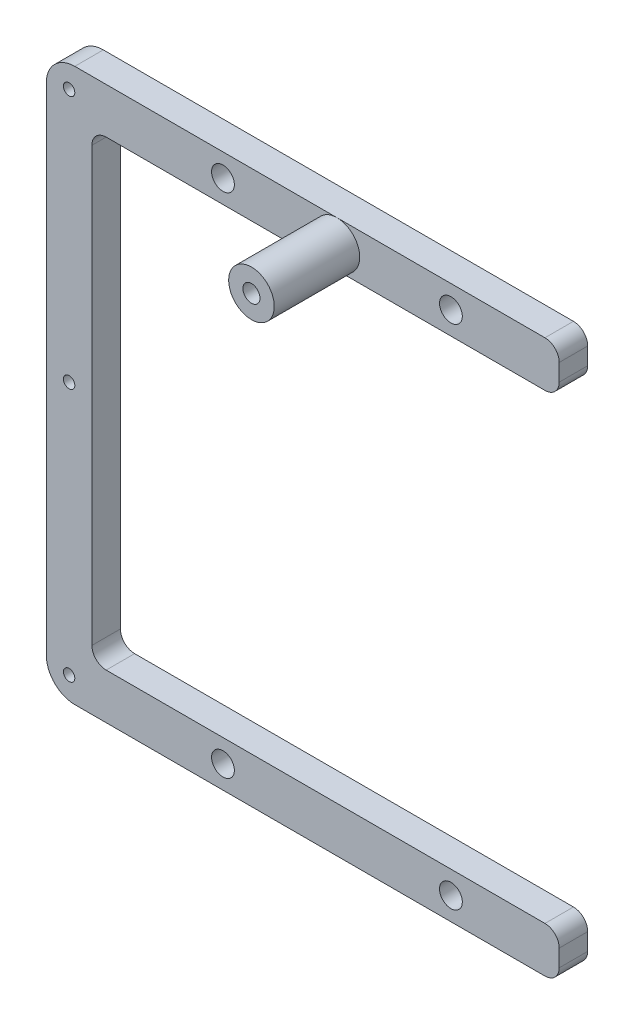
ISO-10303-21;
HEADER;
FILE_DESCRIPTION(('STEP AP214'),'2;1');
FILE_NAME('part.step','',(''),(''),'','','');
FILE_SCHEMA(('AUTOMOTIVE_DESIGN { 1 0 10303 214 1 1 1 1 }'));
ENDSEC;
DATA;
#1=APPLICATION_CONTEXT('core data for automotive mechanical design processes');
#2=APPLICATION_PROTOCOL_DEFINITION('international standard','automotive_design',2000,#1);
#3=PRODUCT_CONTEXT('',#1,'mechanical');
#4=PRODUCT('Part','Part','',(#3));
#5=PRODUCT_RELATED_PRODUCT_CATEGORY('part','',(#4));
#6=PRODUCT_DEFINITION_FORMATION('','',#4);
#7=PRODUCT_DEFINITION_CONTEXT('part definition',#1,'design');
#8=PRODUCT_DEFINITION('design','',#6,#7);
#9=PRODUCT_DEFINITION_SHAPE('','',#8);
#10=(LENGTH_UNIT() NAMED_UNIT(*) SI_UNIT(.MILLI.,.METRE.));
#11=(NAMED_UNIT(*) PLANE_ANGLE_UNIT() SI_UNIT($,.RADIAN.));
#12=(NAMED_UNIT(*) SI_UNIT($,.STERADIAN.) SOLID_ANGLE_UNIT());
#13=UNCERTAINTY_MEASURE_WITH_UNIT(LENGTH_MEASURE(1.E-05),#10,'distance_accuracy_value','');
#14=(GEOMETRIC_REPRESENTATION_CONTEXT(3) GLOBAL_UNCERTAINTY_ASSIGNED_CONTEXT((#13)) GLOBAL_UNIT_ASSIGNED_CONTEXT((#10,
#11,#12)) REPRESENTATION_CONTEXT('',''));
#15=CARTESIAN_POINT('',(0.,0.,0.));
#16=DIRECTION('',(0.,0.,1.));
#17=DIRECTION('',(1.,0.,0.));
#18=AXIS2_PLACEMENT_3D('',#15,#16,#17);
#19=CARTESIAN_POINT('',(5.,-43.5,5.));
#20=DIRECTION('',(0.,0.,-1.));
#21=DIRECTION('',(-1.,0.,0.));
#22=AXIS2_PLACEMENT_3D('',#19,#20,#21);
#23=CYLINDRICAL_SURFACE('',#22,5.);
#24=CARTESIAN_POINT('',(5.,-43.5,0.));
#25=DIRECTION('',(0.,0.,1.));
#26=DIRECTION('',(1.,0.,0.));
#27=AXIS2_PLACEMENT_3D('',#24,#25,#26);
#28=CIRCLE('',#27,5.);
#29=CARTESIAN_POINT('',(0.,-43.5,0.));
#30=VERTEX_POINT('',#29);
#31=CARTESIAN_POINT('',(5.00000000000001,-48.5,0.));
#32=VERTEX_POINT('',#31);
#33=EDGE_CURVE('P0_E160',#30,#32,#28,.T.);
#34=ORIENTED_EDGE('',*,*,#33,.T.);
#35=DIRECTION('',(0.,0.,-1.));
#36=VECTOR('',#35,1.);
#37=CARTESIAN_POINT('',(5.00000000000001,-48.5,5.));
#38=LINE('',#37,#36);
#39=CARTESIAN_POINT('',(5.00000000000001,-48.5,5.));
#40=VERTEX_POINT('',#39);
#41=EDGE_CURVE('P0_E11',#40,#32,#38,.T.);
#42=ORIENTED_EDGE('',*,*,#41,.F.);
#43=CARTESIAN_POINT('',(5.,-43.5,5.));
#44=DIRECTION('',(0.,0.,1.));
#45=DIRECTION('',(1.,0.,0.));
#46=AXIS2_PLACEMENT_3D('',#43,#44,#45);
#47=CIRCLE('',#46,5.);
#48=CARTESIAN_POINT('',(0.,-43.5,5.));
#49=VERTEX_POINT('',#48);
#50=EDGE_CURVE('P0_E191',#49,#40,#47,.T.);
#51=ORIENTED_EDGE('',*,*,#50,.F.);
#52=DIRECTION('',(0.,0.,-1.));
#53=VECTOR('',#52,1.);
#54=CARTESIAN_POINT('',(0.,-43.5,5.));
#55=LINE('',#54,#53);
#56=EDGE_CURVE('P0_E156',#49,#30,#55,.T.);
#57=ORIENTED_EDGE('',*,*,#56,.T.);
#58=EDGE_LOOP('',(#34,#42,#51,#57));
#59=FACE_BOUND('',#58,.T.);
#60=ADVANCED_FACE('P0_F16',(#59),#23,.T.);
#61=CARTESIAN_POINT('',(87.5,-48.5,5.));
#62=DIRECTION('',(0.,1.,0.));
#63=DIRECTION('',(-1.,0.,0.));
#64=AXIS2_PLACEMENT_3D('',#61,#62,#63);
#65=PLANE('',#64);
#66=DIRECTION('',(1.,0.,0.));
#67=VECTOR('',#66,1.);
#68=CARTESIAN_POINT('',(87.5,-48.5,0.));
#69=LINE('',#68,#67);
#70=CARTESIAN_POINT('',(87.5,-48.5,0.));
#71=VERTEX_POINT('',#70);
#72=EDGE_CURVE('P0_E163',#32,#71,#69,.T.);
#73=ORIENTED_EDGE('',*,*,#72,.T.);
#74=DIRECTION('',(0.,0.,-1.));
#75=VECTOR('',#74,1.);
#76=CARTESIAN_POINT('',(87.5,-48.5,5.));
#77=LINE('',#76,#75);
#78=CARTESIAN_POINT('',(87.5,-48.5,5.));
#79=VERTEX_POINT('',#78);
#80=EDGE_CURVE('P0_E24',#79,#71,#77,.T.);
#81=ORIENTED_EDGE('',*,*,#80,.F.);
#82=DIRECTION('',(1.,0.,0.));
#83=VECTOR('',#82,1.);
#84=CARTESIAN_POINT('',(87.5,-48.5,5.));
#85=LINE('',#84,#83);
#86=EDGE_CURVE('P0_E99',#40,#79,#85,.T.);
#87=ORIENTED_EDGE('',*,*,#86,.F.);
#88=ORIENTED_EDGE('',*,*,#41,.T.);
#89=EDGE_LOOP('',(#73,#81,#87,#88));
#90=FACE_BOUND('',#89,.T.);
#91=ADVANCED_FACE('P0_F291',(#90),#65,.F.);
#92=CARTESIAN_POINT('',(87.5,-46.,5.));
#93=DIRECTION('',(0.,0.,-1.));
#94=DIRECTION('',(-1.,0.,0.));
#95=AXIS2_PLACEMENT_3D('',#92,#93,#94);
#96=CYLINDRICAL_SURFACE('',#95,2.5);
#97=CARTESIAN_POINT('',(87.5,-46.,0.));
#98=DIRECTION('',(0.,0.,1.));
#99=DIRECTION('',(-1.,0.,0.));
#100=AXIS2_PLACEMENT_3D('',#97,#98,#99);
#101=CIRCLE('',#100,2.5);
#102=CARTESIAN_POINT('',(90.,-46.,0.));
#103=VERTEX_POINT('',#102);
#104=EDGE_CURVE('P0_E166',#71,#103,#101,.T.);
#105=ORIENTED_EDGE('',*,*,#104,.T.);
#106=DIRECTION('',(0.,0.,-1.));
#107=VECTOR('',#106,1.);
#108=CARTESIAN_POINT('',(90.,-46.,5.));
#109=LINE('',#108,#107);
#110=CARTESIAN_POINT('',(90.,-46.,5.));
#111=VERTEX_POINT('',#110);
#112=EDGE_CURVE('P0_E222',#111,#103,#109,.T.);
#113=ORIENTED_EDGE('',*,*,#112,.F.);
#114=CARTESIAN_POINT('',(87.5,-46.,5.));
#115=DIRECTION('',(0.,0.,1.));
#116=DIRECTION('',(-1.,0.,0.));
#117=AXIS2_PLACEMENT_3D('',#114,#115,#116);
#118=CIRCLE('',#117,2.5);
#119=EDGE_CURVE('P0_E230',#79,#111,#118,.T.);
#120=ORIENTED_EDGE('',*,*,#119,.F.);
#121=ORIENTED_EDGE('',*,*,#80,.T.);
#122=EDGE_LOOP('',(#105,#113,#120,#121));
#123=FACE_BOUND('',#122,.T.);
#124=ADVANCED_FACE('P0_F228',(#123),#96,.T.);
#125=CARTESIAN_POINT('',(90.,-43.,5.));
#126=DIRECTION('',(-1.,0.,0.));
#127=DIRECTION('',(0.,-1.,0.));
#128=AXIS2_PLACEMENT_3D('',#125,#126,#127);
#129=PLANE('',#128);
#130=DIRECTION('',(0.,1.,0.));
#131=VECTOR('',#130,1.);
#132=CARTESIAN_POINT('',(90.,-43.,0.));
#133=LINE('',#132,#131);
#134=CARTESIAN_POINT('',(90.,-43.,0.));
#135=VERTEX_POINT('',#134);
#136=EDGE_CURVE('P0_E168',#103,#135,#133,.T.);
#137=ORIENTED_EDGE('',*,*,#136,.T.);
#138=DIRECTION('',(0.,0.,-1.));
#139=VECTOR('',#138,1.);
#140=CARTESIAN_POINT('',(90.,-43.,5.));
#141=LINE('',#140,#139);
#142=CARTESIAN_POINT('',(90.,-43.,5.));
#143=VERTEX_POINT('',#142);
#144=EDGE_CURVE('P0_E219',#143,#135,#141,.T.);
#145=ORIENTED_EDGE('',*,*,#144,.F.);
#146=DIRECTION('',(0.,1.,0.));
#147=VECTOR('',#146,1.);
#148=CARTESIAN_POINT('',(90.,-43.,5.));
#149=LINE('',#148,#147);
#150=EDGE_CURVE('P0_E248',#111,#143,#149,.T.);
#151=ORIENTED_EDGE('',*,*,#150,.F.);
#152=ORIENTED_EDGE('',*,*,#112,.T.);
#153=EDGE_LOOP('',(#137,#145,#151,#152));
#154=FACE_BOUND('',#153,.T.);
#155=ADVANCED_FACE('P0_F239',(#154),#129,.F.);
#156=CARTESIAN_POINT('',(87.5,-43.,5.));
#157=DIRECTION('',(0.,0.,-1.));
#158=DIRECTION('',(-1.,0.,0.));
#159=AXIS2_PLACEMENT_3D('',#156,#157,#158);
#160=CYLINDRICAL_SURFACE('',#159,2.50000000000001);
#161=CARTESIAN_POINT('',(87.5,-43.,0.));
#162=DIRECTION('',(0.,0.,1.));
#163=DIRECTION('',(1.,0.,0.));
#164=AXIS2_PLACEMENT_3D('',#161,#162,#163);
#165=CIRCLE('',#164,2.50000000000001);
#166=CARTESIAN_POINT('',(87.5,-40.5,0.));
#167=VERTEX_POINT('',#166);
#168=EDGE_CURVE('P0_E170',#135,#167,#165,.T.);
#169=ORIENTED_EDGE('',*,*,#168,.T.);
#170=DIRECTION('',(0.,0.,-1.));
#171=VECTOR('',#170,1.);
#172=CARTESIAN_POINT('',(87.5,-40.5,5.));
#173=LINE('',#172,#171);
#174=CARTESIAN_POINT('',(87.5,-40.5,5.));
#175=VERTEX_POINT('',#174);
#176=EDGE_CURVE('P0_E216',#175,#167,#173,.T.);
#177=ORIENTED_EDGE('',*,*,#176,.F.);
#178=CARTESIAN_POINT('',(87.5,-43.,5.));
#179=DIRECTION('',(0.,0.,1.));
#180=DIRECTION('',(1.,0.,0.));
#181=AXIS2_PLACEMENT_3D('',#178,#179,#180);
#182=CIRCLE('',#181,2.50000000000001);
#183=EDGE_CURVE('P0_E245',#143,#175,#182,.T.);
#184=ORIENTED_EDGE('',*,*,#183,.F.);
#185=ORIENTED_EDGE('',*,*,#144,.T.);
#186=EDGE_LOOP('',(#169,#177,#184,#185));
#187=FACE_BOUND('',#186,.T.);
#188=ADVANCED_FACE('P0_F243',(#187),#160,.T.);
#189=CARTESIAN_POINT('',(10.5,-40.5,5.));
#190=DIRECTION('',(0.,-1.,0.));
#191=DIRECTION('',(1.,0.,0.));
#192=AXIS2_PLACEMENT_3D('',#189,#190,#191);
#193=PLANE('',#192);
#194=DIRECTION('',(-1.,0.,0.));
#195=VECTOR('',#194,1.);
#196=CARTESIAN_POINT('',(10.5,-40.5,0.));
#197=LINE('',#196,#195);
#198=CARTESIAN_POINT('',(10.5,-40.5,0.));
#199=VERTEX_POINT('',#198);
#200=EDGE_CURVE('P0_E172',#167,#199,#197,.T.);
#201=ORIENTED_EDGE('',*,*,#200,.T.);
#202=DIRECTION('',(0.,0.,-1.));
#203=VECTOR('',#202,1.);
#204=CARTESIAN_POINT('',(10.5,-40.5,5.));
#205=LINE('',#204,#203);
#206=CARTESIAN_POINT('',(10.5,-40.5,5.));
#207=VERTEX_POINT('',#206);
#208=EDGE_CURVE('P0_E213',#207,#199,#205,.T.);
#209=ORIENTED_EDGE('',*,*,#208,.F.);
#210=DIRECTION('',(-1.,0.,0.));
#211=VECTOR('',#210,1.);
#212=CARTESIAN_POINT('',(10.5,-40.5,5.));
#213=LINE('',#212,#211);
#214=EDGE_CURVE('P0_E247',#175,#207,#213,.T.);
#215=ORIENTED_EDGE('',*,*,#214,.F.);
#216=ORIENTED_EDGE('',*,*,#176,.T.);
#217=EDGE_LOOP('',(#201,#209,#215,#216));
#218=FACE_BOUND('',#217,.T.);
#219=ADVANCED_FACE('P0_F304',(#218),#193,.F.);
#220=CARTESIAN_POINT('',(10.5,-38.,5.));
#221=DIRECTION('',(0.,0.,-1.));
#222=DIRECTION('',(-1.,0.,0.));
#223=AXIS2_PLACEMENT_3D('',#220,#221,#222);
#224=CYLINDRICAL_SURFACE('',#223,2.50000000000001);
#225=CARTESIAN_POINT('',(10.5,-38.,0.));
#226=DIRECTION('',(0.,0.,-1.));
#227=DIRECTION('',(1.,0.,0.));
#228=AXIS2_PLACEMENT_3D('',#225,#226,#227);
#229=CIRCLE('',#228,2.50000000000001);
#230=CARTESIAN_POINT('',(8.00000000000001,-38.,0.));
#231=VERTEX_POINT('',#230);
#232=EDGE_CURVE('P0_E174',#199,#231,#229,.T.);
#233=ORIENTED_EDGE('',*,*,#232,.T.);
#234=DIRECTION('',(0.,0.,-1.));
#235=VECTOR('',#234,1.);
#236=CARTESIAN_POINT('',(8.00000000000001,-38.,5.));
#237=LINE('',#236,#235);
#238=CARTESIAN_POINT('',(8.00000000000001,-38.,5.));
#239=VERTEX_POINT('',#238);
#240=EDGE_CURVE('P0_E210',#239,#231,#237,.T.);
#241=ORIENTED_EDGE('',*,*,#240,.F.);
#242=CARTESIAN_POINT('',(10.5,-38.,5.));
#243=DIRECTION('',(0.,0.,-1.));
#244=DIRECTION('',(1.,0.,0.));
#245=AXIS2_PLACEMENT_3D('',#242,#243,#244);
#246=CIRCLE('',#245,2.50000000000001);
#247=EDGE_CURVE('P0_E250',#207,#239,#246,.T.);
#248=ORIENTED_EDGE('',*,*,#247,.F.);
#249=ORIENTED_EDGE('',*,*,#208,.T.);
#250=EDGE_LOOP('',(#233,#241,#248,#249));
#251=FACE_BOUND('',#250,.T.);
#252=ADVANCED_FACE('P0_F307',(#251),#224,.F.);
#253=CARTESIAN_POINT('',(8.,38.,5.));
#254=DIRECTION('',(-1.,0.,0.));
#255=DIRECTION('',(0.,-1.,0.));
#256=AXIS2_PLACEMENT_3D('',#253,#254,#255);
#257=PLANE('',#256);
#258=DIRECTION('',(0.,1.,0.));
#259=VECTOR('',#258,1.);
#260=CARTESIAN_POINT('',(8.,38.,0.));
#261=LINE('',#260,#259);
#262=CARTESIAN_POINT('',(8.,38.,0.));
#263=VERTEX_POINT('',#262);
#264=EDGE_CURVE('P0_E176',#231,#263,#261,.T.);
#265=ORIENTED_EDGE('',*,*,#264,.T.);
#266=DIRECTION('',(0.,0.,-1.));
#267=VECTOR('',#266,1.);
#268=CARTESIAN_POINT('',(8.,38.,5.));
#269=LINE('',#268,#267);
#270=CARTESIAN_POINT('',(8.,38.,5.));
#271=VERTEX_POINT('',#270);
#272=EDGE_CURVE('P0_E207',#271,#263,#269,.T.);
#273=ORIENTED_EDGE('',*,*,#272,.F.);
#274=DIRECTION('',(0.,1.,0.));
#275=VECTOR('',#274,1.);
#276=CARTESIAN_POINT('',(8.,38.,5.));
#277=LINE('',#276,#275);
#278=EDGE_CURVE('P0_E256',#239,#271,#277,.T.);
#279=ORIENTED_EDGE('',*,*,#278,.F.);
#280=ORIENTED_EDGE('',*,*,#240,.T.);
#281=EDGE_LOOP('',(#265,#273,#279,#280));
#282=FACE_BOUND('',#281,.T.);
#283=ADVANCED_FACE('P0_F311',(#282),#257,.F.);
#284=CARTESIAN_POINT('',(10.5,38.,5.));
#285=DIRECTION('',(0.,0.,-1.));
#286=DIRECTION('',(-1.,0.,0.));
#287=AXIS2_PLACEMENT_3D('',#284,#285,#286);
#288=CYLINDRICAL_SURFACE('',#287,2.50000000000001);
#289=CARTESIAN_POINT('',(10.5,38.,0.));
#290=DIRECTION('',(0.,0.,-1.));
#291=DIRECTION('',(1.,0.,0.));
#292=AXIS2_PLACEMENT_3D('',#289,#290,#291);
#293=CIRCLE('',#292,2.50000000000001);
#294=CARTESIAN_POINT('',(10.5,40.5,0.));
#295=VERTEX_POINT('',#294);
#296=EDGE_CURVE('P0_E178',#263,#295,#293,.T.);
#297=ORIENTED_EDGE('',*,*,#296,.T.);
#298=DIRECTION('',(0.,0.,-1.));
#299=VECTOR('',#298,1.);
#300=CARTESIAN_POINT('',(10.5,40.5,5.));
#301=LINE('',#300,#299);
#302=CARTESIAN_POINT('',(10.5,40.5,5.));
#303=VERTEX_POINT('',#302);
#304=EDGE_CURVE('P0_E204',#303,#295,#301,.T.);
#305=ORIENTED_EDGE('',*,*,#304,.F.);
#306=CARTESIAN_POINT('',(10.5,38.,5.));
#307=DIRECTION('',(0.,0.,-1.));
#308=DIRECTION('',(1.,0.,0.));
#309=AXIS2_PLACEMENT_3D('',#306,#307,#308);
#310=CIRCLE('',#309,2.50000000000001);
#311=EDGE_CURVE('P0_E258',#271,#303,#310,.T.);
#312=ORIENTED_EDGE('',*,*,#311,.F.);
#313=ORIENTED_EDGE('',*,*,#272,.T.);
#314=EDGE_LOOP('',(#297,#305,#312,#313));
#315=FACE_BOUND('',#314,.T.);
#316=ADVANCED_FACE('P0_F315',(#315),#288,.F.);
#317=CARTESIAN_POINT('',(87.5,40.5,5.));
#318=DIRECTION('',(0.,1.,0.));
#319=DIRECTION('',(0.,0.,1.));
#320=AXIS2_PLACEMENT_3D('',#317,#318,#319);
#321=PLANE('',#320);
#322=DIRECTION('',(1.,0.,0.));
#323=VECTOR('',#322,1.);
#324=CARTESIAN_POINT('',(87.5,40.5,0.));
#325=LINE('',#324,#323);
#326=CARTESIAN_POINT('',(87.5,40.5,0.));
#327=VERTEX_POINT('',#326);
#328=EDGE_CURVE('P0_E180',#295,#327,#325,.T.);
#329=ORIENTED_EDGE('',*,*,#328,.T.);
#330=DIRECTION('',(0.,0.,-1.));
#331=VECTOR('',#330,1.);
#332=CARTESIAN_POINT('',(87.5,40.5,5.));
#333=LINE('',#332,#331);
#334=CARTESIAN_POINT('',(87.5,40.5,5.));
#335=VERTEX_POINT('',#334);
#336=EDGE_CURVE('P0_E201',#335,#327,#333,.T.);
#337=ORIENTED_EDGE('',*,*,#336,.F.);
#338=DIRECTION('',(1.,0.,0.));
#339=VECTOR('',#338,1.);
#340=CARTESIAN_POINT('',(87.5,40.5,5.));
#341=LINE('',#340,#339);
#342=EDGE_CURVE('P0_E260',#303,#335,#341,.T.);
#343=ORIENTED_EDGE('',*,*,#342,.F.);
#344=ORIENTED_EDGE('',*,*,#304,.T.);
#345=EDGE_LOOP('',(#329,#337,#343,#344));
#346=FACE_BOUND('',#345,.T.);
#347=ADVANCED_FACE('P0_F319',(#346),#321,.F.);
#348=CARTESIAN_POINT('',(87.5,43.,5.));
#349=DIRECTION('',(0.,0.,-1.));
#350=DIRECTION('',(-1.,0.,0.));
#351=AXIS2_PLACEMENT_3D('',#348,#349,#350);
#352=CYLINDRICAL_SURFACE('',#351,2.5);
#353=CARTESIAN_POINT('',(87.5,43.,0.));
#354=DIRECTION('',(0.,0.,1.));
#355=DIRECTION('',(-1.,0.,0.));
#356=AXIS2_PLACEMENT_3D('',#353,#354,#355);
#357=CIRCLE('',#356,2.5);
#358=CARTESIAN_POINT('',(90.,43.,0.));
#359=VERTEX_POINT('',#358);
#360=EDGE_CURVE('P0_E182',#327,#359,#357,.T.);
#361=ORIENTED_EDGE('',*,*,#360,.T.);
#362=DIRECTION('',(0.,0.,-1.));
#363=VECTOR('',#362,1.);
#364=CARTESIAN_POINT('',(90.,43.,5.));
#365=LINE('',#364,#363);
#366=CARTESIAN_POINT('',(90.,43.,5.));
#367=VERTEX_POINT('',#366);
#368=EDGE_CURVE('P0_E198',#367,#359,#365,.T.);
#369=ORIENTED_EDGE('',*,*,#368,.F.);
#370=CARTESIAN_POINT('',(87.5,43.,5.));
#371=DIRECTION('',(0.,0.,1.));
#372=DIRECTION('',(-1.,0.,0.));
#373=AXIS2_PLACEMENT_3D('',#370,#371,#372);
#374=CIRCLE('',#373,2.5);
#375=EDGE_CURVE('P0_E262',#335,#367,#374,.T.);
#376=ORIENTED_EDGE('',*,*,#375,.F.);
#377=ORIENTED_EDGE('',*,*,#336,.T.);
#378=EDGE_LOOP('',(#361,#369,#376,#377));
#379=FACE_BOUND('',#378,.T.);
#380=ADVANCED_FACE('P0_F323',(#379),#352,.T.);
#381=CARTESIAN_POINT('',(90.,46.,5.));
#382=DIRECTION('',(-1.,0.,0.));
#383=DIRECTION('',(0.,0.,1.));
#384=AXIS2_PLACEMENT_3D('',#381,#382,#383);
#385=PLANE('',#384);
#386=DIRECTION('',(0.,1.,0.));
#387=VECTOR('',#386,1.);
#388=CARTESIAN_POINT('',(90.,46.,0.));
#389=LINE('',#388,#387);
#390=CARTESIAN_POINT('',(90.,46.,0.));
#391=VERTEX_POINT('',#390);
#392=EDGE_CURVE('P0_E184',#359,#391,#389,.T.);
#393=ORIENTED_EDGE('',*,*,#392,.T.);
#394=DIRECTION('',(0.,0.,-1.));
#395=VECTOR('',#394,1.);
#396=CARTESIAN_POINT('',(90.,46.,5.));
#397=LINE('',#396,#395);
#398=CARTESIAN_POINT('',(90.,46.,5.));
#399=VERTEX_POINT('',#398);
#400=EDGE_CURVE('P0_E195',#399,#391,#397,.T.);
#401=ORIENTED_EDGE('',*,*,#400,.F.);
#402=DIRECTION('',(0.,1.,0.));
#403=VECTOR('',#402,1.);
#404=CARTESIAN_POINT('',(90.,46.,5.));
#405=LINE('',#404,#403);
#406=EDGE_CURVE('P0_E264',#367,#399,#405,.T.);
#407=ORIENTED_EDGE('',*,*,#406,.F.);
#408=ORIENTED_EDGE('',*,*,#368,.T.);
#409=EDGE_LOOP('',(#393,#401,#407,#408));
#410=FACE_BOUND('',#409,.T.);
#411=ADVANCED_FACE('P0_F270',(#410),#385,.F.);
#412=CARTESIAN_POINT('',(87.5,46.,5.));
#413=DIRECTION('',(0.,0.,-1.));
#414=DIRECTION('',(-1.,0.,0.));
#415=AXIS2_PLACEMENT_3D('',#412,#413,#414);
#416=CYLINDRICAL_SURFACE('',#415,2.5);
#417=CARTESIAN_POINT('',(87.5,46.,0.));
#418=DIRECTION('',(0.,0.,1.));
#419=DIRECTION('',(-1.,0.,0.));
#420=AXIS2_PLACEMENT_3D('',#417,#418,#419);
#421=CIRCLE('',#420,2.5);
#422=CARTESIAN_POINT('',(87.5,48.5,0.));
#423=VERTEX_POINT('',#422);
#424=EDGE_CURVE('P0_E186',#391,#423,#421,.T.);
#425=ORIENTED_EDGE('',*,*,#424,.T.);
#426=DIRECTION('',(0.,0.,-1.));
#427=VECTOR('',#426,1.);
#428=CARTESIAN_POINT('',(87.5,48.5,5.));
#429=LINE('',#428,#427);
#430=CARTESIAN_POINT('',(87.5,48.5,5.));
#431=VERTEX_POINT('',#430);
#432=EDGE_CURVE('P0_E151',#431,#423,#429,.T.);
#433=ORIENTED_EDGE('',*,*,#432,.F.);
#434=CARTESIAN_POINT('',(87.5,46.,5.));
#435=DIRECTION('',(0.,0.,1.));
#436=DIRECTION('',(-1.,0.,0.));
#437=AXIS2_PLACEMENT_3D('',#434,#435,#436);
#438=CIRCLE('',#437,2.5);
#439=EDGE_CURVE('P0_E142',#399,#431,#438,.T.);
#440=ORIENTED_EDGE('',*,*,#439,.F.);
#441=ORIENTED_EDGE('',*,*,#400,.T.);
#442=EDGE_LOOP('',(#425,#433,#440,#441));
#443=FACE_BOUND('',#442,.T.);
#444=ADVANCED_FACE('P0_F274',(#443),#416,.T.);
#445=CARTESIAN_POINT('',(4.99999999999999,48.5,5.));
#446=DIRECTION('',(0.,-1.,0.));
#447=DIRECTION('',(0.,0.,-1.));
#448=AXIS2_PLACEMENT_3D('',#445,#446,#447);
#449=PLANE('',#448);
#450=DIRECTION('',(-1.,0.,0.));
#451=VECTOR('',#450,1.);
#452=CARTESIAN_POINT('',(4.99999999999999,48.5,0.));
#453=LINE('',#452,#451);
#454=CARTESIAN_POINT('',(4.99999999999999,48.5,0.));
#455=VERTEX_POINT('',#454);
#456=EDGE_CURVE('P0_E150',#423,#455,#453,.T.);
#457=ORIENTED_EDGE('',*,*,#456,.T.);
#458=DIRECTION('',(0.,0.,-1.));
#459=VECTOR('',#458,1.);
#460=CARTESIAN_POINT('',(4.99999999999999,48.5,5.));
#461=LINE('',#460,#459);
#462=CARTESIAN_POINT('',(4.99999999999999,48.5,5.));
#463=VERTEX_POINT('',#462);
#464=EDGE_CURVE('P0_E147',#463,#455,#461,.T.);
#465=ORIENTED_EDGE('',*,*,#464,.F.);
#466=DIRECTION('',(-1.,0.,0.));
#467=VECTOR('',#466,1.);
#468=CARTESIAN_POINT('',(4.99999999999999,48.5,5.));
#469=LINE('',#468,#467);
#470=EDGE_CURVE('P0_E136',#431,#463,#469,.T.);
#471=ORIENTED_EDGE('',*,*,#470,.F.);
#472=ORIENTED_EDGE('',*,*,#432,.T.);
#473=EDGE_LOOP('',(#457,#465,#471,#472));
#474=FACE_BOUND('',#473,.T.);
#475=ADVANCED_FACE('P0_F148',(#474),#449,.F.);
#476=CARTESIAN_POINT('',(4.99999999999999,43.5,5.));
#477=DIRECTION('',(0.,0.,-1.));
#478=DIRECTION('',(-1.,0.,0.));
#479=AXIS2_PLACEMENT_3D('',#476,#477,#478);
#480=CYLINDRICAL_SURFACE('',#479,5.);
#481=CARTESIAN_POINT('',(4.99999999999999,43.5,0.));
#482=DIRECTION('',(0.,0.,1.));
#483=DIRECTION('',(-1.,0.,0.));
#484=AXIS2_PLACEMENT_3D('',#481,#482,#483);
#485=CIRCLE('',#484,5.);
#486=CARTESIAN_POINT('',(0.,43.5,0.));
#487=VERTEX_POINT('',#486);
#488=EDGE_CURVE('P0_E85',#455,#487,#485,.T.);
#489=ORIENTED_EDGE('',*,*,#488,.T.);
#490=DIRECTION('',(0.,0.,-1.));
#491=VECTOR('',#490,1.);
#492=CARTESIAN_POINT('',(0.,43.5,5.));
#493=LINE('',#492,#491);
#494=CARTESIAN_POINT('',(0.,43.5,5.));
#495=VERTEX_POINT('',#494);
#496=EDGE_CURVE('P0_E152',#495,#487,#493,.T.);
#497=ORIENTED_EDGE('',*,*,#496,.F.);
#498=CARTESIAN_POINT('',(4.99999999999999,43.5,5.));
#499=DIRECTION('',(0.,0.,1.));
#500=DIRECTION('',(-1.,0.,0.));
#501=AXIS2_PLACEMENT_3D('',#498,#499,#500);
#502=CIRCLE('',#501,5.);
#503=EDGE_CURVE('P0_E140',#463,#495,#502,.T.);
#504=ORIENTED_EDGE('',*,*,#503,.F.);
#505=ORIENTED_EDGE('',*,*,#464,.T.);
#506=EDGE_LOOP('',(#489,#497,#504,#505));
#507=FACE_BOUND('',#506,.T.);
#508=ADVANCED_FACE('P0_F154',(#507),#480,.T.);
#509=CARTESIAN_POINT('',(0.,-43.5,5.));
#510=DIRECTION('',(1.,0.,0.));
#511=DIRECTION('',(0.,1.,0.));
#512=AXIS2_PLACEMENT_3D('',#509,#510,#511);
#513=PLANE('',#512);
#514=DIRECTION('',(0.,-1.,0.));
#515=VECTOR('',#514,1.);
#516=CARTESIAN_POINT('',(0.,-43.5,0.));
#517=LINE('',#516,#515);
#518=EDGE_CURVE('P0_E91',#487,#30,#517,.T.);
#519=ORIENTED_EDGE('',*,*,#518,.T.);
#520=ORIENTED_EDGE('',*,*,#56,.F.);
#521=DIRECTION('',(0.,-1.,0.));
#522=VECTOR('',#521,1.);
#523=CARTESIAN_POINT('',(0.,-43.5,5.));
#524=LINE('',#523,#522);
#525=EDGE_CURVE('P0_E32',#495,#49,#524,.T.);
#526=ORIENTED_EDGE('',*,*,#525,.F.);
#527=ORIENTED_EDGE('',*,*,#496,.T.);
#528=EDGE_LOOP('',(#519,#520,#526,#527));
#529=FACE_BOUND('',#528,.T.);
#530=ADVANCED_FACE('P0_F278',(#529),#513,.F.);
#531=CARTESIAN_POINT('',(5.,-43.5,5.));
#532=DIRECTION('',(0.,0.,1.));
#533=DIRECTION('',(1.,0.,0.));
#534=AXIS2_PLACEMENT_3D('',#531,#532,#533);
#535=PLANE('',#534);
#536=CARTESIAN_POINT('',(3.99999999999999,44.5,5.));
#537=DIRECTION('',(0.,0.,1.));
#538=DIRECTION('',(1.,0.,0.));
#539=AXIS2_PLACEMENT_3D('',#536,#537,#538);
#540=CIRCLE('',#539,1.);
#541=CARTESIAN_POINT('',(4.99999999999999,44.5,5.));
#542=VERTEX_POINT('',#541);
#543=EDGE_CURVE('P0_E618',#542,#542,#540,.T.);
#544=ORIENTED_EDGE('',*,*,#543,.F.);
#545=EDGE_LOOP('',(#544));
#546=FACE_BOUND('',#545,.T.);
#547=CARTESIAN_POINT('',(4.,-44.5,5.));
#548=DIRECTION('',(0.,0.,1.));
#549=DIRECTION('',(1.,0.,0.));
#550=AXIS2_PLACEMENT_3D('',#547,#548,#549);
#551=CIRCLE('',#550,1.);
#552=CARTESIAN_POINT('',(5.,-44.5,5.));
#553=VERTEX_POINT('',#552);
#554=EDGE_CURVE('P0_E632',#553,#553,#551,.T.);
#555=ORIENTED_EDGE('',*,*,#554,.F.);
#556=EDGE_LOOP('',(#555));
#557=FACE_BOUND('',#556,.T.);
#558=CARTESIAN_POINT('',(4.,0.,5.));
#559=DIRECTION('',(0.,0.,1.));
#560=DIRECTION('',(1.,0.,0.));
#561=AXIS2_PLACEMENT_3D('',#558,#559,#560);
#562=CIRCLE('',#561,1.);
#563=CARTESIAN_POINT('',(5.,0.,5.));
#564=VERTEX_POINT('',#563);
#565=EDGE_CURVE('P0_E629',#564,#564,#562,.T.);
#566=ORIENTED_EDGE('',*,*,#565,.F.);
#567=EDGE_LOOP('',(#566));
#568=FACE_BOUND('',#567,.T.);
#569=CARTESIAN_POINT('',(31.,44.5,5.));
#570=DIRECTION('',(0.,0.,1.));
#571=DIRECTION('',(1.,0.,0.));
#572=AXIS2_PLACEMENT_3D('',#569,#570,#571);
#573=CIRCLE('',#572,2.00000000000001);
#574=CARTESIAN_POINT('',(33.,44.5,5.));
#575=VERTEX_POINT('',#574);
#576=EDGE_CURVE('P0_E645',#575,#575,#573,.T.);
#577=ORIENTED_EDGE('',*,*,#576,.F.);
#578=EDGE_LOOP('',(#577));
#579=FACE_BOUND('',#578,.T.);
#580=CARTESIAN_POINT('',(71.,-44.5,5.));
#581=DIRECTION('',(0.,0.,1.));
#582=DIRECTION('',(-1.,0.,0.));
#583=AXIS2_PLACEMENT_3D('',#580,#581,#582);
#584=CIRCLE('',#583,2.);
#585=CARTESIAN_POINT('',(69.,-44.5,5.));
#586=VERTEX_POINT('',#585);
#587=EDGE_CURVE('P0_E652',#586,#586,#584,.T.);
#588=ORIENTED_EDGE('',*,*,#587,.F.);
#589=EDGE_LOOP('',(#588));
#590=FACE_BOUND('',#589,.T.);
#591=CARTESIAN_POINT('',(31.,-44.5,5.));
#592=DIRECTION('',(0.,0.,1.));
#593=DIRECTION('',(-1.,0.,0.));
#594=AXIS2_PLACEMENT_3D('',#591,#592,#593);
#595=CIRCLE('',#594,2.00000000000001);
#596=CARTESIAN_POINT('',(29.,-44.5,5.));
#597=VERTEX_POINT('',#596);
#598=EDGE_CURVE('P0_E633',#597,#597,#595,.T.);
#599=ORIENTED_EDGE('',*,*,#598,.F.);
#600=EDGE_LOOP('',(#599));
#601=FACE_BOUND('',#600,.T.);
#602=CARTESIAN_POINT('',(51.,44.5,5.));
#603=DIRECTION('',(0.,0.,1.));
#604=DIRECTION('',(1.,0.,0.));
#605=AXIS2_PLACEMENT_3D('',#602,#603,#604);
#606=CIRCLE('',#605,2.);
#607=CARTESIAN_POINT('',(53.,44.5,5.));
#608=VERTEX_POINT('',#607);
#609=EDGE_CURVE('P0_E640',#608,#608,#606,.T.);
#610=ORIENTED_EDGE('',*,*,#609,.F.);
#611=EDGE_LOOP('',(#610));
#612=FACE_BOUND('',#611,.T.);
#613=CARTESIAN_POINT('',(71.,44.5,5.));
#614=DIRECTION('',(0.,0.,1.));
#615=DIRECTION('',(1.,0.,0.));
#616=AXIS2_PLACEMENT_3D('',#613,#614,#615);
#617=CIRCLE('',#616,2.);
#618=CARTESIAN_POINT('',(73.,44.5,5.));
#619=VERTEX_POINT('',#618);
#620=EDGE_CURVE('P0_E648',#619,#619,#617,.T.);
#621=ORIENTED_EDGE('',*,*,#620,.F.);
#622=EDGE_LOOP('',(#621));
#623=FACE_BOUND('',#622,.T.);
#624=ORIENTED_EDGE('',*,*,#50,.T.);
#625=ORIENTED_EDGE('',*,*,#86,.T.);
#626=ORIENTED_EDGE('',*,*,#119,.T.);
#627=ORIENTED_EDGE('',*,*,#150,.T.);
#628=ORIENTED_EDGE('',*,*,#183,.T.);
#629=ORIENTED_EDGE('',*,*,#214,.T.);
#630=ORIENTED_EDGE('',*,*,#247,.T.);
#631=ORIENTED_EDGE('',*,*,#278,.T.);
#632=ORIENTED_EDGE('',*,*,#311,.T.);
#633=ORIENTED_EDGE('',*,*,#342,.T.);
#634=ORIENTED_EDGE('',*,*,#375,.T.);
#635=ORIENTED_EDGE('',*,*,#406,.T.);
#636=ORIENTED_EDGE('',*,*,#439,.T.);
#637=ORIENTED_EDGE('',*,*,#470,.T.);
#638=ORIENTED_EDGE('',*,*,#503,.T.);
#639=ORIENTED_EDGE('',*,*,#525,.T.);
#640=EDGE_LOOP('',(#624,#625,#626,#627,#628,#629,#630,#631,#632,#633,#634,#635,#636,#637,#638,#639));
#641=FACE_BOUND('',#640,.T.);
#642=ADVANCED_FACE('P0_F138',(#546,#557,#568,#579,#590,#601,#612,#623,#641),#535,.T.);
#643=CARTESIAN_POINT('',(5.,-43.5,0.));
#644=DIRECTION('',(0.,0.,1.));
#645=DIRECTION('',(1.,0.,0.));
#646=AXIS2_PLACEMENT_3D('',#643,#644,#645);
#647=PLANE('',#646);
#648=CARTESIAN_POINT('',(31.,44.5,0.));
#649=DIRECTION('',(0.,0.,1.));
#650=DIRECTION('',(1.,0.,0.));
#651=AXIS2_PLACEMENT_3D('',#648,#649,#650);
#652=CIRCLE('',#651,2.00000000000001);
#653=CARTESIAN_POINT('',(33.,44.5,0.));
#654=VERTEX_POINT('',#653);
#655=EDGE_CURVE('P0_E649',#654,#654,#652,.T.);
#656=ORIENTED_EDGE('',*,*,#655,.T.);
#657=EDGE_LOOP('',(#656));
#658=FACE_BOUND('',#657,.T.);
#659=CARTESIAN_POINT('',(71.,-44.5,0.));
#660=DIRECTION('',(0.,0.,1.));
#661=DIRECTION('',(-1.,0.,0.));
#662=AXIS2_PLACEMENT_3D('',#659,#660,#661);
#663=CIRCLE('',#662,2.);
#664=CARTESIAN_POINT('',(69.,-44.5,0.));
#665=VERTEX_POINT('',#664);
#666=EDGE_CURVE('P0_E636',#665,#665,#663,.T.);
#667=ORIENTED_EDGE('',*,*,#666,.T.);
#668=EDGE_LOOP('',(#667));
#669=FACE_BOUND('',#668,.T.);
#670=CARTESIAN_POINT('',(31.,-44.5,0.));
#671=DIRECTION('',(0.,0.,1.));
#672=DIRECTION('',(-1.,0.,0.));
#673=AXIS2_PLACEMENT_3D('',#670,#671,#672);
#674=CIRCLE('',#673,2.00000000000001);
#675=CARTESIAN_POINT('',(29.,-44.5,0.));
#676=VERTEX_POINT('',#675);
#677=EDGE_CURVE('P0_E637',#676,#676,#674,.T.);
#678=ORIENTED_EDGE('',*,*,#677,.T.);
#679=EDGE_LOOP('',(#678));
#680=FACE_BOUND('',#679,.T.);
#681=CARTESIAN_POINT('',(51.,44.5,0.));
#682=DIRECTION('',(0.,0.,1.));
#683=DIRECTION('',(1.,0.,0.));
#684=AXIS2_PLACEMENT_3D('',#681,#682,#683);
#685=CIRCLE('',#684,2.);
#686=CARTESIAN_POINT('',(53.,44.5,0.));
#687=VERTEX_POINT('',#686);
#688=EDGE_CURVE('P0_E628',#687,#687,#685,.T.);
#689=ORIENTED_EDGE('',*,*,#688,.T.);
#690=EDGE_LOOP('',(#689));
#691=FACE_BOUND('',#690,.T.);
#692=CARTESIAN_POINT('',(71.,44.5,0.));
#693=DIRECTION('',(0.,0.,1.));
#694=DIRECTION('',(1.,0.,0.));
#695=AXIS2_PLACEMENT_3D('',#692,#693,#694);
#696=CIRCLE('',#695,2.);
#697=CARTESIAN_POINT('',(73.,44.5,0.));
#698=VERTEX_POINT('',#697);
#699=EDGE_CURVE('P0_E164',#698,#698,#696,.T.);
#700=ORIENTED_EDGE('',*,*,#699,.T.);
#701=EDGE_LOOP('',(#700));
#702=FACE_BOUND('',#701,.T.);
#703=ORIENTED_EDGE('',*,*,#33,.F.);
#704=ORIENTED_EDGE('',*,*,#518,.F.);
#705=ORIENTED_EDGE('',*,*,#488,.F.);
#706=ORIENTED_EDGE('',*,*,#456,.F.);
#707=ORIENTED_EDGE('',*,*,#424,.F.);
#708=ORIENTED_EDGE('',*,*,#392,.F.);
#709=ORIENTED_EDGE('',*,*,#360,.F.);
#710=ORIENTED_EDGE('',*,*,#328,.F.);
#711=ORIENTED_EDGE('',*,*,#296,.F.);
#712=ORIENTED_EDGE('',*,*,#264,.F.);
#713=ORIENTED_EDGE('',*,*,#232,.F.);
#714=ORIENTED_EDGE('',*,*,#200,.F.);
#715=ORIENTED_EDGE('',*,*,#168,.F.);
#716=ORIENTED_EDGE('',*,*,#136,.F.);
#717=ORIENTED_EDGE('',*,*,#104,.F.);
#718=ORIENTED_EDGE('',*,*,#72,.F.);
#719=EDGE_LOOP('',(#703,#704,#705,#706,#707,#708,#709,#710,#711,#712,#713,#714,#715,#716,#717,#718));
#720=FACE_BOUND('',#719,.T.);
#721=ADVANCED_FACE('P0_F234',(#658,#669,#680,#691,#702,#720),#647,.F.);
#722=CARTESIAN_POINT('',(71.,44.5,0.));
#723=DIRECTION('',(0.,0.,1.));
#724=DIRECTION('',(1.,0.,0.));
#725=AXIS2_PLACEMENT_3D('',#722,#723,#724);
#726=CYLINDRICAL_SURFACE('',#725,2.);
#727=ORIENTED_EDGE('',*,*,#699,.F.);
#728=EDGE_LOOP('',(#727));
#729=FACE_BOUND('',#728,.T.);
#730=ORIENTED_EDGE('',*,*,#620,.T.);
#731=EDGE_LOOP('',(#730));
#732=FACE_BOUND('',#731,.T.);
#733=ADVANCED_FACE('P0_F370',(#729,#732),#726,.F.);
#734=CARTESIAN_POINT('',(51.,44.5,0.));
#735=DIRECTION('',(0.,0.,1.));
#736=DIRECTION('',(1.,0.,0.));
#737=AXIS2_PLACEMENT_3D('',#734,#735,#736);
#738=CYLINDRICAL_SURFACE('',#737,2.);
#739=ORIENTED_EDGE('',*,*,#688,.F.);
#740=EDGE_LOOP('',(#739));
#741=FACE_BOUND('',#740,.T.);
#742=ORIENTED_EDGE('',*,*,#609,.T.);
#743=EDGE_LOOP('',(#742));
#744=FACE_BOUND('',#743,.T.);
#745=ADVANCED_FACE('P0_F380',(#741,#744),#738,.F.);
#746=CARTESIAN_POINT('',(31.,-44.5,0.));
#747=DIRECTION('',(0.,0.,1.));
#748=DIRECTION('',(1.,0.,0.));
#749=AXIS2_PLACEMENT_3D('',#746,#747,#748);
#750=CYLINDRICAL_SURFACE('',#749,2.00000000000001);
#751=ORIENTED_EDGE('',*,*,#677,.F.);
#752=EDGE_LOOP('',(#751));
#753=FACE_BOUND('',#752,.T.);
#754=ORIENTED_EDGE('',*,*,#598,.T.);
#755=EDGE_LOOP('',(#754));
#756=FACE_BOUND('',#755,.T.);
#757=ADVANCED_FACE('P0_F391',(#753,#756),#750,.F.);
#758=CARTESIAN_POINT('',(71.,-44.5,0.));
#759=DIRECTION('',(0.,0.,1.));
#760=DIRECTION('',(1.,0.,0.));
#761=AXIS2_PLACEMENT_3D('',#758,#759,#760);
#762=CYLINDRICAL_SURFACE('',#761,2.);
#763=ORIENTED_EDGE('',*,*,#666,.F.);
#764=EDGE_LOOP('',(#763));
#765=FACE_BOUND('',#764,.T.);
#766=ORIENTED_EDGE('',*,*,#587,.T.);
#767=EDGE_LOOP('',(#766));
#768=FACE_BOUND('',#767,.T.);
#769=ADVANCED_FACE('P0_F402',(#765,#768),#762,.F.);
#770=CARTESIAN_POINT('',(31.,44.5,0.));
#771=DIRECTION('',(0.,0.,1.));
#772=DIRECTION('',(1.,0.,0.));
#773=AXIS2_PLACEMENT_3D('',#770,#771,#772);
#774=CYLINDRICAL_SURFACE('',#773,2.00000000000001);
#775=ORIENTED_EDGE('',*,*,#655,.F.);
#776=EDGE_LOOP('',(#775));
#777=FACE_BOUND('',#776,.T.);
#778=ORIENTED_EDGE('',*,*,#576,.T.);
#779=EDGE_LOOP('',(#778));
#780=FACE_BOUND('',#779,.T.);
#781=ADVANCED_FACE('P0_F413',(#777,#780),#774,.F.);
#782=CARTESIAN_POINT('',(4.,0.,2.));
#783=DIRECTION('',(0.,0.,1.));
#784=DIRECTION('',(1.,0.,0.));
#785=AXIS2_PLACEMENT_3D('',#782,#783,#784);
#786=CYLINDRICAL_SURFACE('',#785,1.);
#787=CARTESIAN_POINT('',(4.,0.,2.));
#788=DIRECTION('',(0.,0.,1.));
#789=DIRECTION('',(1.,0.,0.));
#790=AXIS2_PLACEMENT_3D('',#787,#788,#789);
#791=CIRCLE('',#790,1.);
#792=CARTESIAN_POINT('',(5.,0.,2.));
#793=VERTEX_POINT('',#792);
#794=EDGE_CURVE('P0_E625',#793,#793,#791,.T.);
#795=ORIENTED_EDGE('',*,*,#794,.F.);
#796=EDGE_LOOP('',(#795));
#797=FACE_BOUND('',#796,.T.);
#798=ORIENTED_EDGE('',*,*,#565,.T.);
#799=EDGE_LOOP('',(#798));
#800=FACE_BOUND('',#799,.T.);
#801=ADVANCED_FACE('P0_F424',(#797,#800),#786,.F.);
#802=CARTESIAN_POINT('',(4.,0.,2.));
#803=DIRECTION('',(0.,0.,1.));
#804=DIRECTION('',(1.,0.,0.));
#805=AXIS2_PLACEMENT_3D('',#802,#803,#804);
#806=PLANE('',#805);
#807=ORIENTED_EDGE('',*,*,#794,.T.);
#808=EDGE_LOOP('',(#807));
#809=FACE_BOUND('',#808,.T.);
#810=ADVANCED_FACE('P0_F435',(#809),#806,.T.);
#811=CARTESIAN_POINT('',(4.,-44.5,2.));
#812=DIRECTION('',(0.,0.,1.));
#813=DIRECTION('',(1.,0.,0.));
#814=AXIS2_PLACEMENT_3D('',#811,#812,#813);
#815=CYLINDRICAL_SURFACE('',#814,1.);
#816=CARTESIAN_POINT('',(4.,-44.5,2.));
#817=DIRECTION('',(0.,0.,1.));
#818=DIRECTION('',(1.,0.,0.));
#819=AXIS2_PLACEMENT_3D('',#816,#817,#818);
#820=CIRCLE('',#819,1.);
#821=CARTESIAN_POINT('',(5.,-44.5,2.));
#822=VERTEX_POINT('',#821);
#823=EDGE_CURVE('P0_E621',#822,#822,#820,.T.);
#824=ORIENTED_EDGE('',*,*,#823,.F.);
#825=EDGE_LOOP('',(#824));
#826=FACE_BOUND('',#825,.T.);
#827=ORIENTED_EDGE('',*,*,#554,.T.);
#828=EDGE_LOOP('',(#827));
#829=FACE_BOUND('',#828,.T.);
#830=ADVANCED_FACE('P0_F446',(#826,#829),#815,.F.);
#831=CARTESIAN_POINT('',(4.,-44.5,2.));
#832=DIRECTION('',(0.,0.,1.));
#833=DIRECTION('',(1.,0.,0.));
#834=AXIS2_PLACEMENT_3D('',#831,#832,#833);
#835=PLANE('',#834);
#836=ORIENTED_EDGE('',*,*,#823,.T.);
#837=EDGE_LOOP('',(#836));
#838=FACE_BOUND('',#837,.T.);
#839=ADVANCED_FACE('P0_F457',(#838),#835,.T.);
#840=CARTESIAN_POINT('',(3.99999999999999,44.5,2.));
#841=DIRECTION('',(0.,0.,1.));
#842=DIRECTION('',(1.,0.,0.));
#843=AXIS2_PLACEMENT_3D('',#840,#841,#842);
#844=CYLINDRICAL_SURFACE('',#843,1.);
#845=CARTESIAN_POINT('',(3.99999999999999,44.5,2.));
#846=DIRECTION('',(0.,0.,1.));
#847=DIRECTION('',(1.,0.,0.));
#848=AXIS2_PLACEMENT_3D('',#845,#846,#847);
#849=CIRCLE('',#848,1.);
#850=CARTESIAN_POINT('',(4.99999999999999,44.5,2.));
#851=VERTEX_POINT('',#850);
#852=EDGE_CURVE('P0_E617',#851,#851,#849,.T.);
#853=ORIENTED_EDGE('',*,*,#852,.F.);
#854=EDGE_LOOP('',(#853));
#855=FACE_BOUND('',#854,.T.);
#856=ORIENTED_EDGE('',*,*,#543,.T.);
#857=EDGE_LOOP('',(#856));
#858=FACE_BOUND('',#857,.T.);
#859=ADVANCED_FACE('P0_F468',(#855,#858),#844,.F.);
#860=CARTESIAN_POINT('',(3.99999999999999,44.5,2.));
#861=DIRECTION('',(0.,0.,1.));
#862=DIRECTION('',(1.,0.,0.));
#863=AXIS2_PLACEMENT_3D('',#860,#861,#862);
#864=PLANE('',#863);
#865=ORIENTED_EDGE('',*,*,#852,.T.);
#866=EDGE_LOOP('',(#865));
#867=FACE_BOUND('',#866,.T.);
#868=ADVANCED_FACE('P0_F479',(#867),#864,.T.);
#869=CLOSED_SHELL('',(#60,#91,#124,#155,#188,#219,#252,#283,#316,#347,#380,#411,#444,#475,#508,
#530,#642,#721,#733,#745,#757,#769,#781,#801,#810,#830,#839,#859,#868));
#870=MANIFOLD_SOLID_BREP('P0_B1',#869);
#871=CARTESIAN_POINT('',(51.,44.5,5.));
#872=DIRECTION('',(0.,0.,1.));
#873=DIRECTION('',(0.923728021347068,0.383049008063238,0.));
#874=AXIS2_PLACEMENT_3D('',#871,#872,#873);
#875=CYLINDRICAL_SURFACE('',#874,4.);
#876=CARTESIAN_POINT('',(51.,44.5,5.));
#877=DIRECTION('',(0.,0.,-1.));
#878=DIRECTION('',(-0.923728021347068,-0.383049008063238,0.));
#879=AXIS2_PLACEMENT_3D('',#876,#877,#878);
#880=CIRCLE('',#879,4.);
#881=CARTESIAN_POINT('',(47.3050879146117,42.967803967747,5.));
#882=VERTEX_POINT('',#881);
#883=EDGE_CURVE('P1_E20',#882,#882,#880,.T.);
#884=ORIENTED_EDGE('',*,*,#883,.F.);
#885=EDGE_LOOP('',(#884));
#886=FACE_BOUND('',#885,.T.);
#887=CARTESIAN_POINT('',(51.,44.5,20.));
#888=DIRECTION('',(0.,0.,-1.));
#889=DIRECTION('',(-0.923728021347068,-0.383049008063238,0.));
#890=AXIS2_PLACEMENT_3D('',#887,#888,#889);
#891=CIRCLE('',#890,4.);
#892=CARTESIAN_POINT('',(47.3050879146117,42.967803967747,20.));
#893=VERTEX_POINT('',#892);
#894=EDGE_CURVE('P1_E16',#893,#893,#891,.T.);
#895=ORIENTED_EDGE('',*,*,#894,.T.);
#896=EDGE_LOOP('',(#895));
#897=FACE_BOUND('',#896,.T.);
#898=ADVANCED_FACE('P1_F13',(#886,#897),#875,.T.);
#899=CARTESIAN_POINT('',(51.,44.5,5.));
#900=DIRECTION('',(0.,0.,-1.));
#901=DIRECTION('',(-0.923728021347068,-0.383049008063238,0.));
#902=AXIS2_PLACEMENT_3D('',#899,#900,#901);
#903=PLANE('',#902);
#904=CARTESIAN_POINT('',(51.,44.5,5.));
#905=DIRECTION('',(0.,0.,-1.));
#906=DIRECTION('',(-0.923728021347068,-0.383049008063238,0.));
#907=AXIS2_PLACEMENT_3D('',#904,#905,#906);
#908=CIRCLE('',#907,2.);
#909=CARTESIAN_POINT('',(49.1525439573058,43.7339019838735,5.));
#910=VERTEX_POINT('',#909);
#911=EDGE_CURVE('P1_E9',#910,#910,#908,.T.);
#912=ORIENTED_EDGE('',*,*,#911,.F.);
#913=EDGE_LOOP('',(#912));
#914=FACE_BOUND('',#913,.T.);
#915=ORIENTED_EDGE('',*,*,#883,.T.);
#916=EDGE_LOOP('',(#915));
#917=FACE_BOUND('',#916,.T.);
#918=ADVANCED_FACE('P1_F49',(#914,#917),#903,.T.);
#919=CARTESIAN_POINT('',(51.,44.5,20.));
#920=DIRECTION('',(0.,0.,-1.));
#921=DIRECTION('',(-0.923728021347068,-0.383049008063238,0.));
#922=AXIS2_PLACEMENT_3D('',#919,#920,#921);
#923=PLANE('',#922);
#924=CARTESIAN_POINT('',(51.,44.5,20.));
#925=DIRECTION('',(0.,0.,1.));
#926=DIRECTION('',(0.923728021347068,0.383049008063238,0.));
#927=AXIS2_PLACEMENT_3D('',#924,#925,#926);
#928=CIRCLE('',#927,1.5);
#929=CARTESIAN_POINT('',(52.3855920320206,45.0745735120948,20.));
#930=VERTEX_POINT('',#929);
#931=EDGE_CURVE('P1_E30',#930,#930,#928,.T.);
#932=ORIENTED_EDGE('',*,*,#931,.F.);
#933=EDGE_LOOP('',(#932));
#934=FACE_BOUND('',#933,.T.);
#935=ORIENTED_EDGE('',*,*,#894,.F.);
#936=EDGE_LOOP('',(#935));
#937=FACE_BOUND('',#936,.T.);
#938=ADVANCED_FACE('P1_F45',(#934,#937),#923,.F.);
#939=CARTESIAN_POINT('',(51.,44.5,0.));
#940=DIRECTION('',(0.,0.,1.));
#941=DIRECTION('',(0.923728021347068,0.383049008063238,0.));
#942=AXIS2_PLACEMENT_3D('',#939,#940,#941);
#943=CYLINDRICAL_SURFACE('',#942,2.);
#944=CARTESIAN_POINT('',(51.,44.5,0.));
#945=DIRECTION('',(0.,0.,-1.));
#946=DIRECTION('',(-0.923728021347068,-0.383049008063238,0.));
#947=AXIS2_PLACEMENT_3D('',#944,#945,#946);
#948=CIRCLE('',#947,2.);
#949=CARTESIAN_POINT('',(49.1525439573058,43.7339019838735,0.));
#950=VERTEX_POINT('',#949);
#951=EDGE_CURVE('P1_E26',#950,#950,#948,.T.);
#952=ORIENTED_EDGE('',*,*,#951,.F.);
#953=EDGE_LOOP('',(#952));
#954=FACE_BOUND('',#953,.T.);
#955=ORIENTED_EDGE('',*,*,#911,.T.);
#956=EDGE_LOOP('',(#955));
#957=FACE_BOUND('',#956,.T.);
#958=ADVANCED_FACE('P1_F48',(#954,#957),#943,.T.);
#959=CARTESIAN_POINT('',(51.,44.5,0.));
#960=DIRECTION('',(0.,0.,-1.));
#961=DIRECTION('',(-0.923728021347068,-0.383049008063238,0.));
#962=AXIS2_PLACEMENT_3D('',#959,#960,#961);
#963=PLANE('',#962);
#964=ORIENTED_EDGE('',*,*,#951,.T.);
#965=EDGE_LOOP('',(#964));
#966=FACE_BOUND('',#965,.T.);
#967=ADVANCED_FACE('P1_F41',(#966),#963,.T.);
#968=CARTESIAN_POINT('',(51.,44.5,10.));
#969=DIRECTION('',(0.,0.,1.));
#970=DIRECTION('',(0.923728021347068,0.383049008063238,0.));
#971=AXIS2_PLACEMENT_3D('',#968,#969,#970);
#972=CYLINDRICAL_SURFACE('',#971,1.5);
#973=CARTESIAN_POINT('',(51.,44.5,10.));
#974=DIRECTION('',(0.,0.,1.));
#975=DIRECTION('',(0.923728021347068,0.383049008063238,0.));
#976=AXIS2_PLACEMENT_3D('',#973,#974,#975);
#977=CIRCLE('',#976,1.5);
#978=CARTESIAN_POINT('',(52.3855920320206,45.0745735120948,10.));
#979=VERTEX_POINT('',#978);
#980=EDGE_CURVE('P1_E29',#979,#979,#977,.T.);
#981=ORIENTED_EDGE('',*,*,#980,.F.);
#982=EDGE_LOOP('',(#981));
#983=FACE_BOUND('',#982,.T.);
#984=ORIENTED_EDGE('',*,*,#931,.T.);
#985=EDGE_LOOP('',(#984));
#986=FACE_BOUND('',#985,.T.);
#987=ADVANCED_FACE('P1_F38',(#983,#986),#972,.F.);
#988=CARTESIAN_POINT('',(51.,44.5,10.));
#989=DIRECTION('',(0.,0.,1.));
#990=DIRECTION('',(0.923728021347068,0.383049008063238,0.));
#991=AXIS2_PLACEMENT_3D('',#988,#989,#990);
#992=PLANE('',#991);
#993=ORIENTED_EDGE('',*,*,#980,.T.);
#994=EDGE_LOOP('',(#993));
#995=FACE_BOUND('',#994,.T.);
#996=ADVANCED_FACE('P1_F36',(#995),#992,.T.);
#997=CLOSED_SHELL('',(#898,#918,#938,#958,#967,#987,#996));
#998=MANIFOLD_SOLID_BREP('P1_B1',#997);
#999=ADVANCED_BREP_SHAPE_REPRESENTATION('',(#18,#870,#998),#14);
#1000=SHAPE_DEFINITION_REPRESENTATION(#9,#999);
ENDSEC;
END-ISO-10303-21;
